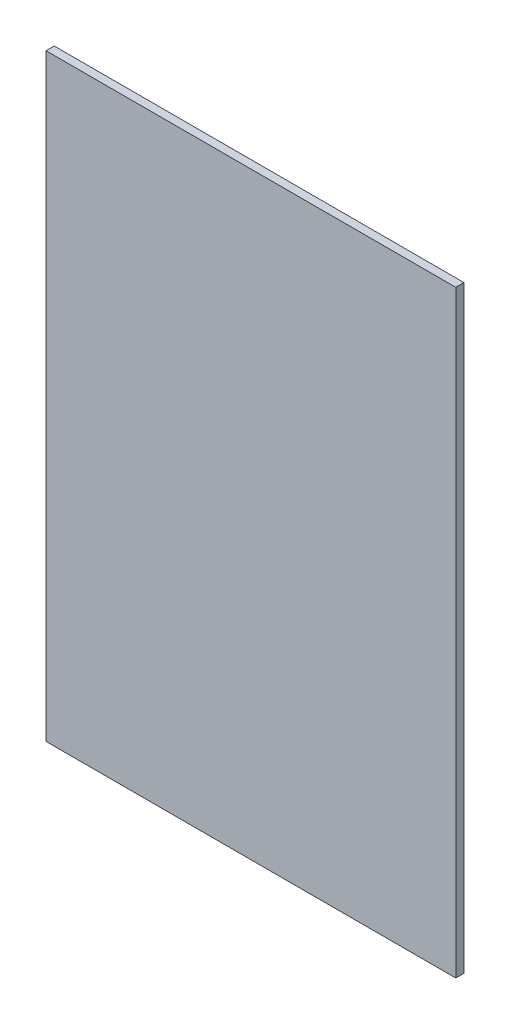
ISO-10303-21;
HEADER;
FILE_DESCRIPTION(('STEP AP214'),'2;1');
FILE_NAME('part.step','',(''),(''),'','','');
FILE_SCHEMA(('AUTOMOTIVE_DESIGN { 1 0 10303 214 1 1 1 1 }'));
ENDSEC;
DATA;
#1=APPLICATION_CONTEXT('core data for automotive mechanical design processes');
#2=APPLICATION_PROTOCOL_DEFINITION('international standard','automotive_design',2000,#1);
#3=PRODUCT_CONTEXT('',#1,'mechanical');
#4=PRODUCT('Part','Part','',(#3));
#5=PRODUCT_RELATED_PRODUCT_CATEGORY('part','',(#4));
#6=PRODUCT_DEFINITION_FORMATION('','',#4);
#7=PRODUCT_DEFINITION_CONTEXT('part definition',#1,'design');
#8=PRODUCT_DEFINITION('design','',#6,#7);
#9=PRODUCT_DEFINITION_SHAPE('','',#8);
#10=(LENGTH_UNIT() NAMED_UNIT(*) SI_UNIT(.MILLI.,.METRE.));
#11=(NAMED_UNIT(*) PLANE_ANGLE_UNIT() SI_UNIT($,.RADIAN.));
#12=(NAMED_UNIT(*) SI_UNIT($,.STERADIAN.) SOLID_ANGLE_UNIT());
#13=UNCERTAINTY_MEASURE_WITH_UNIT(LENGTH_MEASURE(1.E-05),#10,'distance_accuracy_value','');
#14=(GEOMETRIC_REPRESENTATION_CONTEXT(3) GLOBAL_UNCERTAINTY_ASSIGNED_CONTEXT((#13)) GLOBAL_UNIT_ASSIGNED_CONTEXT((#10,
#11,#12)) REPRESENTATION_CONTEXT('',''));
#15=CARTESIAN_POINT('',(0.,0.,0.));
#16=DIRECTION('',(0.,0.,1.));
#17=DIRECTION('',(1.,0.,0.));
#18=AXIS2_PLACEMENT_3D('',#15,#16,#17);
#19=CARTESIAN_POINT('',(0.,0.,6.35));
#20=DIRECTION('',(1.,0.,0.));
#21=DIRECTION('',(0.,1.,0.));
#22=AXIS2_PLACEMENT_3D('',#19,#20,#21);
#23=PLANE('',#22);
#24=DIRECTION('',(0.,-1.,0.));
#25=VECTOR('',#24,1.);
#26=CARTESIAN_POINT('',(0.,0.,0.));
#27=LINE('',#26,#25);
#28=CARTESIAN_POINT('',(-1.11022302462516E-13,463.55,0.));
#29=VERTEX_POINT('',#28);
#30=CARTESIAN_POINT('',(0.,0.,0.));
#31=VERTEX_POINT('',#30);
#32=EDGE_CURVE('E111',#29,#31,#27,.T.);
#33=ORIENTED_EDGE('',*,*,#32,.T.);
#34=DIRECTION('',(0.,0.,-1.));
#35=VECTOR('',#34,1.);
#36=CARTESIAN_POINT('',(0.,0.,6.35));
#37=LINE('',#36,#35);
#38=CARTESIAN_POINT('',(0.,0.,6.35));
#39=VERTEX_POINT('',#38);
#40=EDGE_CURVE('E11',#39,#31,#37,.T.);
#41=ORIENTED_EDGE('',*,*,#40,.F.);
#42=DIRECTION('',(0.,-1.,0.));
#43=VECTOR('',#42,1.);
#44=CARTESIAN_POINT('',(0.,0.,6.35));
#45=LINE('',#44,#43);
#46=CARTESIAN_POINT('',(-1.11022302462516E-13,463.55,6.35));
#47=VERTEX_POINT('',#46);
#48=EDGE_CURVE('E95',#47,#39,#45,.T.);
#49=ORIENTED_EDGE('',*,*,#48,.F.);
#50=DIRECTION('',(0.,0.,-1.));
#51=VECTOR('',#50,1.);
#52=CARTESIAN_POINT('',(-1.11022302462516E-13,463.55,6.35));
#53=LINE('',#52,#51);
#54=EDGE_CURVE('E107',#47,#29,#53,.T.);
#55=ORIENTED_EDGE('',*,*,#54,.T.);
#56=EDGE_LOOP('',(#33,#41,#49,#55));
#57=FACE_BOUND('',#56,.T.);
#58=ADVANCED_FACE('F43',(#57),#23,.F.);
#59=CARTESIAN_POINT('',(0.,0.,6.35));
#60=DIRECTION('',(0.,1.,0.));
#61=DIRECTION('',(0.,0.,1.));
#62=AXIS2_PLACEMENT_3D('',#59,#60,#61);
#63=PLANE('',#62);
#64=DIRECTION('',(1.,0.,0.));
#65=VECTOR('',#64,1.);
#66=CARTESIAN_POINT('',(0.,0.,0.));
#67=LINE('',#66,#65);
#68=CARTESIAN_POINT('',(317.5,0.,0.));
#69=VERTEX_POINT('',#68);
#70=EDGE_CURVE('E100',#31,#69,#67,.T.);
#71=ORIENTED_EDGE('',*,*,#70,.T.);
#72=DIRECTION('',(0.,0.,-1.));
#73=VECTOR('',#72,1.);
#74=CARTESIAN_POINT('',(317.5,0.,6.35));
#75=LINE('',#74,#73);
#76=CARTESIAN_POINT('',(317.5,0.,6.35));
#77=VERTEX_POINT('',#76);
#78=EDGE_CURVE('E52',#77,#69,#75,.T.);
#79=ORIENTED_EDGE('',*,*,#78,.F.);
#80=DIRECTION('',(1.,0.,0.));
#81=VECTOR('',#80,1.);
#82=CARTESIAN_POINT('',(0.,0.,6.35));
#83=LINE('',#82,#81);
#84=EDGE_CURVE('E90',#39,#77,#83,.T.);
#85=ORIENTED_EDGE('',*,*,#84,.F.);
#86=ORIENTED_EDGE('',*,*,#40,.T.);
#87=EDGE_LOOP('',(#71,#79,#85,#86));
#88=FACE_BOUND('',#87,.T.);
#89=ADVANCED_FACE('F99',(#88),#63,.F.);
#90=CARTESIAN_POINT('',(317.5,0.,6.35));
#91=DIRECTION('',(-1.,0.,0.));
#92=DIRECTION('',(0.,-1.,0.));
#93=AXIS2_PLACEMENT_3D('',#90,#91,#92);
#94=PLANE('',#93);
#95=DIRECTION('',(0.,1.,0.));
#96=VECTOR('',#95,1.);
#97=CARTESIAN_POINT('',(317.5,0.,0.));
#98=LINE('',#97,#96);
#99=CARTESIAN_POINT('',(317.5,463.55,0.));
#100=VERTEX_POINT('',#99);
#101=EDGE_CURVE('E77',#69,#100,#98,.T.);
#102=ORIENTED_EDGE('',*,*,#101,.T.);
#103=DIRECTION('',(0.,0.,-1.));
#104=VECTOR('',#103,1.);
#105=CARTESIAN_POINT('',(317.5,463.55,6.35));
#106=LINE('',#105,#104);
#107=CARTESIAN_POINT('',(317.5,463.55,6.35));
#108=VERTEX_POINT('',#107);
#109=EDGE_CURVE('E102',#108,#100,#106,.T.);
#110=ORIENTED_EDGE('',*,*,#109,.F.);
#111=DIRECTION('',(0.,1.,0.));
#112=VECTOR('',#111,1.);
#113=CARTESIAN_POINT('',(317.5,0.,6.35));
#114=LINE('',#113,#112);
#115=EDGE_CURVE('E93',#77,#108,#114,.T.);
#116=ORIENTED_EDGE('',*,*,#115,.F.);
#117=ORIENTED_EDGE('',*,*,#78,.T.);
#118=EDGE_LOOP('',(#102,#110,#116,#117));
#119=FACE_BOUND('',#118,.T.);
#120=ADVANCED_FACE('F103',(#119),#94,.F.);
#121=CARTESIAN_POINT('',(-1.11022302462516E-13,463.55,6.35));
#122=DIRECTION('',(0.,-1.,0.));
#123=DIRECTION('',(0.,0.,-1.));
#124=AXIS2_PLACEMENT_3D('',#121,#122,#123);
#125=PLANE('',#124);
#126=DIRECTION('',(-1.,0.,0.));
#127=VECTOR('',#126,1.);
#128=CARTESIAN_POINT('',(-1.11022302462516E-13,463.55,0.));
#129=LINE('',#128,#127);
#130=EDGE_CURVE('E83',#100,#29,#129,.T.);
#131=ORIENTED_EDGE('',*,*,#130,.T.);
#132=ORIENTED_EDGE('',*,*,#54,.F.);
#133=DIRECTION('',(-1.,0.,0.));
#134=VECTOR('',#133,1.);
#135=CARTESIAN_POINT('',(-1.11022302462516E-13,463.55,6.35));
#136=LINE('',#135,#134);
#137=EDGE_CURVE('E60',#108,#47,#136,.T.);
#138=ORIENTED_EDGE('',*,*,#137,.F.);
#139=ORIENTED_EDGE('',*,*,#109,.T.);
#140=EDGE_LOOP('',(#131,#132,#138,#139));
#141=FACE_BOUND('',#140,.T.);
#142=ADVANCED_FACE('F124',(#141),#125,.F.);
#143=CARTESIAN_POINT('',(0.,0.,6.35));
#144=DIRECTION('',(0.,0.,-1.));
#145=DIRECTION('',(-1.,0.,0.));
#146=AXIS2_PLACEMENT_3D('',#143,#144,#145);
#147=PLANE('',#146);
#148=ORIENTED_EDGE('',*,*,#48,.T.);
#149=ORIENTED_EDGE('',*,*,#84,.T.);
#150=ORIENTED_EDGE('',*,*,#115,.T.);
#151=ORIENTED_EDGE('',*,*,#137,.T.);
#152=EDGE_LOOP('',(#148,#149,#150,#151));
#153=FACE_BOUND('',#152,.T.);
#154=ADVANCED_FACE('F91',(#153),#147,.F.);
#155=CARTESIAN_POINT('',(0.,0.,0.));
#156=DIRECTION('',(0.,0.,-1.));
#157=DIRECTION('',(-1.,0.,0.));
#158=AXIS2_PLACEMENT_3D('',#155,#156,#157);
#159=PLANE('',#158);
#160=ORIENTED_EDGE('',*,*,#32,.F.);
#161=ORIENTED_EDGE('',*,*,#130,.F.);
#162=ORIENTED_EDGE('',*,*,#101,.F.);
#163=ORIENTED_EDGE('',*,*,#70,.F.);
#164=EDGE_LOOP('',(#160,#161,#162,#163));
#165=FACE_BOUND('',#164,.T.);
#166=ADVANCED_FACE('F127',(#165),#159,.T.);
#167=CLOSED_SHELL('',(#58,#89,#120,#142,#154,#166));
#168=MANIFOLD_SOLID_BREP('B2',#167);
#169=ADVANCED_BREP_SHAPE_REPRESENTATION('',(#18,#168),#14);
#170=SHAPE_DEFINITION_REPRESENTATION(#9,#169);
ENDSEC;
END-ISO-10303-21;
